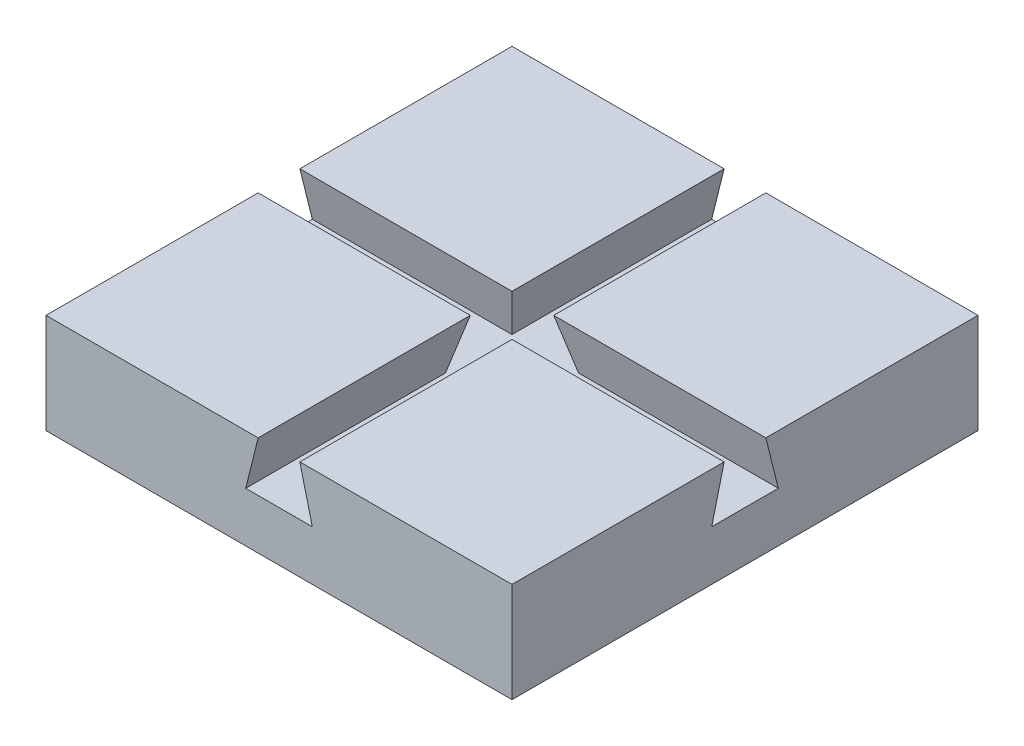
ISO-10303-21;
HEADER;
FILE_DESCRIPTION(('STEP AP214'),'2;1');
FILE_NAME('part.step','',(''),(''),'','','');
FILE_SCHEMA(('AUTOMOTIVE_DESIGN { 1 0 10303 214 1 1 1 1 }'));
ENDSEC;
DATA;
#1=APPLICATION_CONTEXT('core data for automotive mechanical design processes');
#2=APPLICATION_PROTOCOL_DEFINITION('international standard','automotive_design',2000,#1);
#3=PRODUCT_CONTEXT('',#1,'mechanical');
#4=PRODUCT('Part','Part','',(#3));
#5=PRODUCT_RELATED_PRODUCT_CATEGORY('part','',(#4));
#6=PRODUCT_DEFINITION_FORMATION('','',#4);
#7=PRODUCT_DEFINITION_CONTEXT('part definition',#1,'design');
#8=PRODUCT_DEFINITION('design','',#6,#7);
#9=PRODUCT_DEFINITION_SHAPE('','',#8);
#10=(LENGTH_UNIT() NAMED_UNIT(*) SI_UNIT(.MILLI.,.METRE.));
#11=(NAMED_UNIT(*) PLANE_ANGLE_UNIT() SI_UNIT($,.RADIAN.));
#12=(NAMED_UNIT(*) SI_UNIT($,.STERADIAN.) SOLID_ANGLE_UNIT());
#13=UNCERTAINTY_MEASURE_WITH_UNIT(LENGTH_MEASURE(1.E-05),#10,'distance_accuracy_value','');
#14=(GEOMETRIC_REPRESENTATION_CONTEXT(3) GLOBAL_UNCERTAINTY_ASSIGNED_CONTEXT((#13)) GLOBAL_UNIT_ASSIGNED_CONTEXT((#10,
#11,#12)) REPRESENTATION_CONTEXT('',''));
#15=CARTESIAN_POINT('',(0.,0.,0.));
#16=DIRECTION('',(0.,0.,1.));
#17=DIRECTION('',(1.,0.,0.));
#18=AXIS2_PLACEMENT_3D('',#15,#16,#17);
#19=CARTESIAN_POINT('',(-44.45,19.05,-44.45));
#20=DIRECTION('',(0.,1.,0.));
#21=DIRECTION('',(0.,0.,1.));
#22=AXIS2_PLACEMENT_3D('',#19,#20,#21);
#23=PLANE('',#22);
#24=DIRECTION('',(0.,0.,1.));
#25=VECTOR('',#24,1.);
#26=CARTESIAN_POINT('',(-3.97515077291869,19.05,-44.45));
#27=LINE('',#26,#25);
#28=CARTESIAN_POINT('',(-3.97515077291869,19.05,3.97515077291871));
#29=VERTEX_POINT('',#28);
#30=CARTESIAN_POINT('',(-3.97515077291869,19.05,44.45));
#31=VERTEX_POINT('',#30);
#32=EDGE_CURVE('E210',#29,#31,#27,.T.);
#33=ORIENTED_EDGE('',*,*,#32,.F.);
#34=DIRECTION('',(1.,0.,0.));
#35=VECTOR('',#34,1.);
#36=CARTESIAN_POINT('',(-44.45,19.05,3.9751507729187));
#37=LINE('',#36,#35);
#38=CARTESIAN_POINT('',(-44.45,19.05,3.9751507729187));
#39=VERTEX_POINT('',#38);
#40=EDGE_CURVE('E55',#39,#29,#37,.T.);
#41=ORIENTED_EDGE('',*,*,#40,.F.);
#42=DIRECTION('',(0.,0.,-1.));
#43=VECTOR('',#42,1.);
#44=CARTESIAN_POINT('',(-44.45,19.05,44.45));
#45=LINE('',#44,#43);
#46=CARTESIAN_POINT('',(-44.45,19.05,44.45));
#47=VERTEX_POINT('',#46);
#48=EDGE_CURVE('E168',#47,#39,#45,.T.);
#49=ORIENTED_EDGE('',*,*,#48,.F.);
#50=DIRECTION('',(1.,0.,0.));
#51=VECTOR('',#50,1.);
#52=CARTESIAN_POINT('',(-44.45,19.05,44.45));
#53=LINE('',#52,#51);
#54=EDGE_CURVE('E187',#47,#31,#53,.T.);
#55=ORIENTED_EDGE('',*,*,#54,.T.);
#56=EDGE_LOOP('',(#33,#41,#49,#55));
#57=FACE_BOUND('',#56,.T.);
#58=ADVANCED_FACE('F32',(#57),#23,.T.);
#59=DIRECTION('',(0.,0.,1.));
#60=VECTOR('',#59,1.);
#61=CARTESIAN_POINT('',(44.45,19.05,-44.45));
#62=LINE('',#61,#60);
#63=CARTESIAN_POINT('',(44.4499999999834,19.05,3.97515077291871));
#64=VERTEX_POINT('',#63);
#65=CARTESIAN_POINT('',(44.45,19.05,44.45));
#66=VERTEX_POINT('',#65);
#67=EDGE_CURVE('E182',#64,#66,#62,.T.);
#68=ORIENTED_EDGE('',*,*,#67,.F.);
#69=CARTESIAN_POINT('',(3.9751507729187,19.05,3.9751507729187));
#70=VERTEX_POINT('',#69);
#71=EDGE_CURVE('E268',#70,#64,#37,.T.);
#72=ORIENTED_EDGE('',*,*,#71,.F.);
#73=DIRECTION('',(0.,0.,1.));
#74=VECTOR('',#73,1.);
#75=CARTESIAN_POINT('',(3.9751507729187,19.05,-44.45));
#76=LINE('',#75,#74);
#77=CARTESIAN_POINT('',(3.9751507729187,19.05,44.45));
#78=VERTEX_POINT('',#77);
#79=EDGE_CURVE('E232',#70,#78,#76,.T.);
#80=ORIENTED_EDGE('',*,*,#79,.T.);
#81=EDGE_CURVE('E186',#78,#66,#53,.T.);
#82=ORIENTED_EDGE('',*,*,#81,.T.);
#83=EDGE_LOOP('',(#68,#72,#80,#82));
#84=FACE_BOUND('',#83,.T.);
#85=ADVANCED_FACE('F292',(#84),#23,.T.);
#86=CARTESIAN_POINT('',(6.35000000000001,9.525,-44.45));
#87=DIRECTION('',(0.970295726275996,0.241921895599668,0.));
#88=DIRECTION('',(-0.241921895599668,0.970295726275996,0.));
#89=AXIS2_PLACEMENT_3D('',#86,#87,#88);
#90=PLANE('',#89);
#91=DIRECTION('',(-0.235138839312811,0.943090373449569,-0.235138839312811));
#92=VECTOR('',#91,1.);
#93=CARTESIAN_POINT('',(3.5412540933285,20.7902645296249,3.54125409332851));
#94=LINE('',#93,#92);
#95=CARTESIAN_POINT('',(6.35000000000001,9.525,6.34999999999999));
#96=VERTEX_POINT('',#95);
#97=EDGE_CURVE('E154',#96,#70,#94,.T.);
#98=ORIENTED_EDGE('',*,*,#97,.F.);
#99=DIRECTION('',(0.,0.,1.));
#100=VECTOR('',#99,1.);
#101=CARTESIAN_POINT('',(6.35000000000001,9.525,-44.45));
#102=LINE('',#101,#100);
#103=CARTESIAN_POINT('',(6.35000000000001,9.525,44.45));
#104=VERTEX_POINT('',#103);
#105=EDGE_CURVE('E229',#96,#104,#102,.T.);
#106=ORIENTED_EDGE('',*,*,#105,.T.);
#107=DIRECTION('',(-0.241921895599668,0.970295726275996,0.));
#108=VECTOR('',#107,1.);
#109=CARTESIAN_POINT('',(6.35000000000001,9.525,44.45));
#110=LINE('',#109,#108);
#111=EDGE_CURVE('E243',#104,#78,#110,.T.);
#112=ORIENTED_EDGE('',*,*,#111,.T.);
#113=ORIENTED_EDGE('',*,*,#79,.F.);
#114=EDGE_LOOP('',(#98,#106,#112,#113));
#115=FACE_BOUND('',#114,.T.);
#116=ADVANCED_FACE('F240',(#115),#90,.F.);
#117=CARTESIAN_POINT('',(-6.34999999999999,9.525,-44.45));
#118=DIRECTION('',(0.970295726275996,-0.241921895599668,0.));
#119=DIRECTION('',(0.241921895599668,0.970295726275996,0.));
#120=AXIS2_PLACEMENT_3D('',#117,#118,#119);
#121=PLANE('',#120);
#122=DIRECTION('',(0.,0.,1.));
#123=VECTOR('',#122,1.);
#124=CARTESIAN_POINT('',(-6.34999999999999,9.525,-44.45));
#125=LINE('',#124,#123);
#126=CARTESIAN_POINT('',(-6.34999999999998,9.52500000000002,6.35));
#127=VERTEX_POINT('',#126);
#128=CARTESIAN_POINT('',(-6.34999999999999,9.525,44.45));
#129=VERTEX_POINT('',#128);
#130=EDGE_CURVE('E212',#127,#129,#125,.T.);
#131=ORIENTED_EDGE('',*,*,#130,.F.);
#132=DIRECTION('',(0.235138839312811,0.943090373449569,-0.235138839312811));
#133=VECTOR('',#132,1.);
#134=CARTESIAN_POINT('',(-3.54125409332849,20.7902645296249,3.54125409332851));
#135=LINE('',#134,#133);
#136=EDGE_CURVE('E40',#127,#29,#135,.T.);
#137=ORIENTED_EDGE('',*,*,#136,.T.);
#138=ORIENTED_EDGE('',*,*,#32,.T.);
#139=DIRECTION('',(0.241921895599668,0.970295726275996,0.));
#140=VECTOR('',#139,1.);
#141=CARTESIAN_POINT('',(-6.34999999999999,9.525,44.45));
#142=LINE('',#141,#140);
#143=EDGE_CURVE('E225',#129,#31,#142,.T.);
#144=ORIENTED_EDGE('',*,*,#143,.F.);
#145=EDGE_LOOP('',(#131,#137,#138,#144));
#146=FACE_BOUND('',#145,.T.);
#147=ADVANCED_FACE('F208',(#146),#121,.T.);
#148=DIRECTION('',(1.,0.,0.));
#149=VECTOR('',#148,1.);
#150=CARTESIAN_POINT('',(-44.45,19.05,-3.97515077291871));
#151=LINE('',#150,#149);
#152=CARTESIAN_POINT('',(-44.45,19.05,-3.97515077291871));
#153=VERTEX_POINT('',#152);
#154=CARTESIAN_POINT('',(-3.97515077291869,19.05,-3.9751507729187));
#155=VERTEX_POINT('',#154);
#156=EDGE_CURVE('E144',#153,#155,#151,.T.);
#157=ORIENTED_EDGE('',*,*,#156,.T.);
#158=CARTESIAN_POINT('',(-3.97515077291869,19.05,-44.45));
#159=VERTEX_POINT('',#158);
#160=EDGE_CURVE('E218',#159,#155,#27,.T.);
#161=ORIENTED_EDGE('',*,*,#160,.F.);
#162=DIRECTION('',(-1.,0.,0.));
#163=VECTOR('',#162,1.);
#164=CARTESIAN_POINT('',(44.45,19.05,-44.45));
#165=LINE('',#164,#163);
#166=CARTESIAN_POINT('',(-44.45,19.05,-44.45));
#167=VERTEX_POINT('',#166);
#168=EDGE_CURVE('E166',#159,#167,#165,.T.);
#169=ORIENTED_EDGE('',*,*,#168,.T.);
#170=EDGE_CURVE('E158',#153,#167,#45,.T.);
#171=ORIENTED_EDGE('',*,*,#170,.F.);
#172=EDGE_LOOP('',(#157,#161,#169,#171));
#173=FACE_BOUND('',#172,.T.);
#174=ADVANCED_FACE('F164',(#173),#23,.T.);
#175=CARTESIAN_POINT('',(-44.45,19.05,44.45));
#176=DIRECTION('',(-1.,0.,0.));
#177=DIRECTION('',(0.,0.,1.));
#178=AXIS2_PLACEMENT_3D('',#175,#176,#177);
#179=PLANE('',#178);
#180=DIRECTION('',(0.,0.970295726275996,0.241921895599668));
#181=VECTOR('',#180,1.);
#182=CARTESIAN_POINT('',(-44.45,9.52500000000002,-6.35));
#183=LINE('',#182,#181);
#184=CARTESIAN_POINT('',(-44.45,9.52500000000002,-6.35));
#185=VERTEX_POINT('',#184);
#186=EDGE_CURVE('E147',#185,#153,#183,.T.);
#187=ORIENTED_EDGE('',*,*,#186,.T.);
#188=ORIENTED_EDGE('',*,*,#170,.T.);
#189=DIRECTION('',(0.,-1.,0.));
#190=VECTOR('',#189,1.);
#191=CARTESIAN_POINT('',(-44.45,19.05,-44.45));
#192=LINE('',#191,#190);
#193=CARTESIAN_POINT('',(-44.45,0.,-44.45));
#194=VERTEX_POINT('',#193);
#195=EDGE_CURVE('E190',#167,#194,#192,.T.);
#196=ORIENTED_EDGE('',*,*,#195,.T.);
#197=DIRECTION('',(0.,0.,-1.));
#198=VECTOR('',#197,1.);
#199=CARTESIAN_POINT('',(-44.45,0.,44.45));
#200=LINE('',#199,#198);
#201=CARTESIAN_POINT('',(-44.45,0.,44.45));
#202=VERTEX_POINT('',#201);
#203=EDGE_CURVE('E191',#202,#194,#200,.T.);
#204=ORIENTED_EDGE('',*,*,#203,.F.);
#205=DIRECTION('',(0.,-1.,0.));
#206=VECTOR('',#205,1.);
#207=CARTESIAN_POINT('',(-44.45,19.05,44.45));
#208=LINE('',#207,#206);
#209=EDGE_CURVE('E199',#47,#202,#208,.T.);
#210=ORIENTED_EDGE('',*,*,#209,.F.);
#211=ORIENTED_EDGE('',*,*,#48,.T.);
#212=DIRECTION('',(0.,0.970295726275996,-0.241921895599668));
#213=VECTOR('',#212,1.);
#214=CARTESIAN_POINT('',(-44.45,9.52500000000002,6.34999999999999));
#215=LINE('',#214,#213);
#216=CARTESIAN_POINT('',(-44.45,9.52500000000002,6.34999999999999));
#217=VERTEX_POINT('',#216);
#218=EDGE_CURVE('E276',#217,#39,#215,.T.);
#219=ORIENTED_EDGE('',*,*,#218,.F.);
#220=DIRECTION('',(0.,0.,1.));
#221=VECTOR('',#220,1.);
#222=CARTESIAN_POINT('',(-44.45,9.52500000000002,-6.35));
#223=LINE('',#222,#221);
#224=EDGE_CURVE('E161',#185,#217,#223,.T.);
#225=ORIENTED_EDGE('',*,*,#224,.F.);
#226=EDGE_LOOP('',(#187,#188,#196,#204,#210,#211,#219,#225));
#227=FACE_BOUND('',#226,.T.);
#228=ADVANCED_FACE('F34',(#227),#179,.T.);
#229=CARTESIAN_POINT('',(-44.45,19.05,44.45));
#230=DIRECTION('',(0.,0.,-1.));
#231=DIRECTION('',(-1.,0.,0.));
#232=AXIS2_PLACEMENT_3D('',#229,#230,#231);
#233=PLANE('',#232);
#234=ORIENTED_EDGE('',*,*,#81,.F.);
#235=ORIENTED_EDGE('',*,*,#111,.F.);
#236=DIRECTION('',(-1.,0.,0.));
#237=VECTOR('',#236,1.);
#238=CARTESIAN_POINT('',(6.35000000000001,9.525,44.45));
#239=LINE('',#238,#237);
#240=EDGE_CURVE('E247',#104,#129,#239,.T.);
#241=ORIENTED_EDGE('',*,*,#240,.T.);
#242=ORIENTED_EDGE('',*,*,#143,.T.);
#243=ORIENTED_EDGE('',*,*,#54,.F.);
#244=ORIENTED_EDGE('',*,*,#209,.T.);
#245=DIRECTION('',(1.,0.,0.));
#246=VECTOR('',#245,1.);
#247=CARTESIAN_POINT('',(-44.45,0.,44.45));
#248=LINE('',#247,#246);
#249=CARTESIAN_POINT('',(44.45,0.,44.45));
#250=VERTEX_POINT('',#249);
#251=EDGE_CURVE('E169',#202,#250,#248,.T.);
#252=ORIENTED_EDGE('',*,*,#251,.T.);
#253=DIRECTION('',(0.,-1.,0.));
#254=VECTOR('',#253,1.);
#255=CARTESIAN_POINT('',(44.45,19.05,44.45));
#256=LINE('',#255,#254);
#257=EDGE_CURVE('E201',#66,#250,#256,.T.);
#258=ORIENTED_EDGE('',*,*,#257,.F.);
#259=EDGE_LOOP('',(#234,#235,#241,#242,#243,#244,#252,#258));
#260=FACE_BOUND('',#259,.T.);
#261=ADVANCED_FACE('F250',(#260),#233,.F.);
#262=CARTESIAN_POINT('',(44.45,19.05,-44.45));
#263=DIRECTION('',(1.,0.,0.));
#264=DIRECTION('',(0.,0.,-1.));
#265=AXIS2_PLACEMENT_3D('',#262,#263,#264);
#266=PLANE('',#265);
#267=DIRECTION('',(0.,0.970295726275996,0.241921895599668));
#268=VECTOR('',#267,1.);
#269=CARTESIAN_POINT('',(44.4499999999834,9.52500000000002,-6.34999999999999));
#270=LINE('',#269,#268);
#271=CARTESIAN_POINT('',(44.4499999999834,9.52500000000002,-6.34999999999999));
#272=VERTEX_POINT('',#271);
#273=CARTESIAN_POINT('',(44.4499999999834,19.05,-3.9751507729187));
#274=VERTEX_POINT('',#273);
#275=EDGE_CURVE('E274',#272,#274,#270,.T.);
#276=ORIENTED_EDGE('',*,*,#275,.F.);
#277=DIRECTION('',(0.,0.,1.));
#278=VECTOR('',#277,1.);
#279=CARTESIAN_POINT('',(44.4499999999834,9.52500000000002,-6.34999999999999));
#280=LINE('',#279,#278);
#281=CARTESIAN_POINT('',(44.4499999999834,9.52500000000002,6.35));
#282=VERTEX_POINT('',#281);
#283=EDGE_CURVE('E271',#272,#282,#280,.T.);
#284=ORIENTED_EDGE('',*,*,#283,.T.);
#285=DIRECTION('',(0.,0.970295726275996,-0.241921895599668));
#286=VECTOR('',#285,1.);
#287=CARTESIAN_POINT('',(44.4499999999834,9.52500000000002,6.35));
#288=LINE('',#287,#286);
#289=EDGE_CURVE('E162',#282,#64,#288,.T.);
#290=ORIENTED_EDGE('',*,*,#289,.T.);
#291=ORIENTED_EDGE('',*,*,#67,.T.);
#292=ORIENTED_EDGE('',*,*,#257,.T.);
#293=DIRECTION('',(0.,0.,1.));
#294=VECTOR('',#293,1.);
#295=CARTESIAN_POINT('',(44.45,0.,-44.45));
#296=LINE('',#295,#294);
#297=CARTESIAN_POINT('',(44.45,0.,-44.45));
#298=VERTEX_POINT('',#297);
#299=EDGE_CURVE('E173',#298,#250,#296,.T.);
#300=ORIENTED_EDGE('',*,*,#299,.F.);
#301=DIRECTION('',(0.,-1.,0.));
#302=VECTOR('',#301,1.);
#303=CARTESIAN_POINT('',(44.45,19.05,-44.45));
#304=LINE('',#303,#302);
#305=CARTESIAN_POINT('',(44.45,19.05,-44.45));
#306=VERTEX_POINT('',#305);
#307=EDGE_CURVE('E203',#306,#298,#304,.T.);
#308=ORIENTED_EDGE('',*,*,#307,.F.);
#309=EDGE_CURVE('E183',#306,#274,#62,.T.);
#310=ORIENTED_EDGE('',*,*,#309,.T.);
#311=EDGE_LOOP('',(#276,#284,#290,#291,#292,#300,#308,#310));
#312=FACE_BOUND('',#311,.T.);
#313=ADVANCED_FACE('F287',(#312),#266,.T.);
#314=CARTESIAN_POINT('',(44.45,19.05,-44.45));
#315=DIRECTION('',(0.,0.,1.));
#316=DIRECTION('',(1.,0.,0.));
#317=AXIS2_PLACEMENT_3D('',#314,#315,#316);
#318=PLANE('',#317);
#319=DIRECTION('',(-1.,0.,0.));
#320=VECTOR('',#319,1.);
#321=CARTESIAN_POINT('',(6.35000000000001,9.525,-44.45));
#322=LINE('',#321,#320);
#323=CARTESIAN_POINT('',(6.35000000000001,9.525,-44.45));
#324=VERTEX_POINT('',#323);
#325=CARTESIAN_POINT('',(-6.34999999999999,9.525,-44.45));
#326=VERTEX_POINT('',#325);
#327=EDGE_CURVE('E221',#324,#326,#322,.T.);
#328=ORIENTED_EDGE('',*,*,#327,.F.);
#329=DIRECTION('',(-0.241921895599668,0.970295726275996,0.));
#330=VECTOR('',#329,1.);
#331=CARTESIAN_POINT('',(6.35000000000001,9.525,-44.45));
#332=LINE('',#331,#330);
#333=CARTESIAN_POINT('',(3.9751507729187,19.05,-44.45));
#334=VERTEX_POINT('',#333);
#335=EDGE_CURVE('E258',#324,#334,#332,.T.);
#336=ORIENTED_EDGE('',*,*,#335,.T.);
#337=EDGE_CURVE('E179',#306,#334,#165,.T.);
#338=ORIENTED_EDGE('',*,*,#337,.F.);
#339=ORIENTED_EDGE('',*,*,#307,.T.);
#340=DIRECTION('',(-1.,0.,0.));
#341=VECTOR('',#340,1.);
#342=CARTESIAN_POINT('',(44.45,0.,-44.45));
#343=LINE('',#342,#341);
#344=EDGE_CURVE('E194',#298,#194,#343,.T.);
#345=ORIENTED_EDGE('',*,*,#344,.T.);
#346=ORIENTED_EDGE('',*,*,#195,.F.);
#347=ORIENTED_EDGE('',*,*,#168,.F.);
#348=DIRECTION('',(0.241921895599668,0.970295726275996,0.));
#349=VECTOR('',#348,1.);
#350=CARTESIAN_POINT('',(-6.34999999999999,9.525,-44.45));
#351=LINE('',#350,#349);
#352=EDGE_CURVE('E219',#326,#159,#351,.T.);
#353=ORIENTED_EDGE('',*,*,#352,.F.);
#354=EDGE_LOOP('',(#328,#336,#338,#339,#345,#346,#347,#353));
#355=FACE_BOUND('',#354,.T.);
#356=ADVANCED_FACE('F306',(#355),#318,.F.);
#357=CARTESIAN_POINT('',(3.97515077291871,19.05,-3.9751507729187));
#358=VERTEX_POINT('',#357);
#359=EDGE_CURVE('E155',#358,#274,#151,.T.);
#360=ORIENTED_EDGE('',*,*,#359,.T.);
#361=ORIENTED_EDGE('',*,*,#309,.F.);
#362=ORIENTED_EDGE('',*,*,#337,.T.);
#363=EDGE_CURVE('E177',#334,#358,#76,.T.);
#364=ORIENTED_EDGE('',*,*,#363,.T.);
#365=EDGE_LOOP('',(#360,#361,#362,#364));
#366=FACE_BOUND('',#365,.T.);
#367=ADVANCED_FACE('F302',(#366),#23,.T.);
#368=CARTESIAN_POINT('',(-44.45,0.,-44.45));
#369=DIRECTION('',(0.,1.,0.));
#370=DIRECTION('',(0.,0.,1.));
#371=AXIS2_PLACEMENT_3D('',#368,#369,#370);
#372=PLANE('',#371);
#373=ORIENTED_EDGE('',*,*,#203,.T.);
#374=ORIENTED_EDGE('',*,*,#344,.F.);
#375=ORIENTED_EDGE('',*,*,#299,.T.);
#376=ORIENTED_EDGE('',*,*,#251,.F.);
#377=EDGE_LOOP('',(#373,#374,#375,#376));
#378=FACE_BOUND('',#377,.T.);
#379=ADVANCED_FACE('F282',(#378),#372,.F.);
#380=CARTESIAN_POINT('',(6.35000000000001,9.52500000000002,-6.35));
#381=VERTEX_POINT('',#380);
#382=EDGE_CURVE('E230',#324,#381,#102,.T.);
#383=ORIENTED_EDGE('',*,*,#382,.T.);
#384=DIRECTION('',(-0.235138839312811,0.943090373449569,0.235138839312811));
#385=VECTOR('',#384,1.);
#386=CARTESIAN_POINT('',(8.45655943000363,1.07605160278134,-8.45655943000362));
#387=LINE('',#386,#385);
#388=EDGE_CURVE('E253',#381,#358,#387,.T.);
#389=ORIENTED_EDGE('',*,*,#388,.T.);
#390=ORIENTED_EDGE('',*,*,#363,.F.);
#391=ORIENTED_EDGE('',*,*,#335,.F.);
#392=EDGE_LOOP('',(#383,#389,#390,#391));
#393=FACE_BOUND('',#392,.T.);
#394=ADVANCED_FACE('F300',(#393),#90,.F.);
#395=CARTESIAN_POINT('',(6.35000000000001,9.525,-44.45));
#396=DIRECTION('',(0.,1.,0.));
#397=DIRECTION('',(0.,0.,1.));
#398=AXIS2_PLACEMENT_3D('',#395,#396,#397);
#399=PLANE('',#398);
#400=CARTESIAN_POINT('',(-6.34999999999999,9.52500000000002,-6.35));
#401=VERTEX_POINT('',#400);
#402=EDGE_CURVE('E227',#326,#401,#125,.T.);
#403=ORIENTED_EDGE('',*,*,#402,.T.);
#404=DIRECTION('',(1.,0.,0.));
#405=VECTOR('',#404,1.);
#406=CARTESIAN_POINT('',(-44.45,9.52500000000002,-6.35));
#407=LINE('',#406,#405);
#408=EDGE_CURVE('E262',#185,#401,#407,.T.);
#409=ORIENTED_EDGE('',*,*,#408,.F.);
#410=ORIENTED_EDGE('',*,*,#224,.T.);
#411=DIRECTION('',(1.,0.,0.));
#412=VECTOR('',#411,1.);
#413=CARTESIAN_POINT('',(-44.45,9.52500000000002,6.34999999999999));
#414=LINE('',#413,#412);
#415=EDGE_CURVE('E265',#217,#127,#414,.T.);
#416=ORIENTED_EDGE('',*,*,#415,.T.);
#417=ORIENTED_EDGE('',*,*,#130,.T.);
#418=ORIENTED_EDGE('',*,*,#240,.F.);
#419=ORIENTED_EDGE('',*,*,#105,.F.);
#420=EDGE_CURVE('E47',#96,#282,#414,.T.);
#421=ORIENTED_EDGE('',*,*,#420,.T.);
#422=ORIENTED_EDGE('',*,*,#283,.F.);
#423=EDGE_CURVE('E264',#381,#272,#407,.T.);
#424=ORIENTED_EDGE('',*,*,#423,.F.);
#425=ORIENTED_EDGE('',*,*,#382,.F.);
#426=ORIENTED_EDGE('',*,*,#327,.T.);
#427=EDGE_LOOP('',(#403,#409,#410,#416,#417,#418,#419,#421,#422,#424,#425,#426));
#428=FACE_BOUND('',#427,.T.);
#429=ADVANCED_FACE('F248',(#428),#399,.T.);
#430=DIRECTION('',(0.235138839312811,0.943090373449569,0.235138839312811));
#431=VECTOR('',#430,1.);
#432=CARTESIAN_POINT('',(-8.45655943000362,1.07605160278134,-8.45655943000363));
#433=LINE('',#432,#431);
#434=EDGE_CURVE('E11',#401,#155,#433,.T.);
#435=ORIENTED_EDGE('',*,*,#434,.F.);
#436=ORIENTED_EDGE('',*,*,#402,.F.);
#437=ORIENTED_EDGE('',*,*,#352,.T.);
#438=ORIENTED_EDGE('',*,*,#160,.T.);
#439=EDGE_LOOP('',(#435,#436,#437,#438));
#440=FACE_BOUND('',#439,.T.);
#441=ADVANCED_FACE('F310',(#440),#121,.T.);
#442=CARTESIAN_POINT('',(-44.45,9.52500000000002,6.34999999999999));
#443=DIRECTION('',(0.,-0.241921895599668,-0.970295726275996));
#444=DIRECTION('',(0.,0.970295726275996,-0.241921895599668));
#445=AXIS2_PLACEMENT_3D('',#442,#443,#444);
#446=PLANE('',#445);
#447=ORIENTED_EDGE('',*,*,#415,.F.);
#448=ORIENTED_EDGE('',*,*,#218,.T.);
#449=ORIENTED_EDGE('',*,*,#40,.T.);
#450=ORIENTED_EDGE('',*,*,#136,.F.);
#451=EDGE_LOOP('',(#447,#448,#449,#450));
#452=FACE_BOUND('',#451,.T.);
#453=ADVANCED_FACE('F278',(#452),#446,.T.);
#454=CARTESIAN_POINT('',(-44.45,9.52500000000002,-6.35));
#455=DIRECTION('',(0.,0.241921895599668,-0.970295726275996));
#456=DIRECTION('',(0.,0.970295726275996,0.241921895599668));
#457=AXIS2_PLACEMENT_3D('',#454,#455,#456);
#458=PLANE('',#457);
#459=ORIENTED_EDGE('',*,*,#434,.T.);
#460=ORIENTED_EDGE('',*,*,#156,.F.);
#461=ORIENTED_EDGE('',*,*,#186,.F.);
#462=ORIENTED_EDGE('',*,*,#408,.T.);
#463=EDGE_LOOP('',(#459,#460,#461,#462));
#464=FACE_BOUND('',#463,.T.);
#465=ADVANCED_FACE('F146',(#464),#458,.F.);
#466=ORIENTED_EDGE('',*,*,#423,.T.);
#467=ORIENTED_EDGE('',*,*,#275,.T.);
#468=ORIENTED_EDGE('',*,*,#359,.F.);
#469=ORIENTED_EDGE('',*,*,#388,.F.);
#470=EDGE_LOOP('',(#466,#467,#468,#469));
#471=FACE_BOUND('',#470,.T.);
#472=ADVANCED_FACE('F297',(#471),#458,.F.);
#473=ORIENTED_EDGE('',*,*,#97,.T.);
#474=ORIENTED_EDGE('',*,*,#71,.T.);
#475=ORIENTED_EDGE('',*,*,#289,.F.);
#476=ORIENTED_EDGE('',*,*,#420,.F.);
#477=EDGE_LOOP('',(#473,#474,#475,#476));
#478=FACE_BOUND('',#477,.T.);
#479=ADVANCED_FACE('F293',(#478),#446,.T.);
#480=CLOSED_SHELL('',(#58,#85,#116,#147,#174,#228,#261,#313,#356,#367,#379,#394,#429,#441,#453,
#465,#472,#479));
#481=MANIFOLD_SOLID_BREP('B2',#480);
#482=ADVANCED_BREP_SHAPE_REPRESENTATION('',(#18,#481),#14);
#483=SHAPE_DEFINITION_REPRESENTATION(#9,#482);
ENDSEC;
END-ISO-10303-21;
